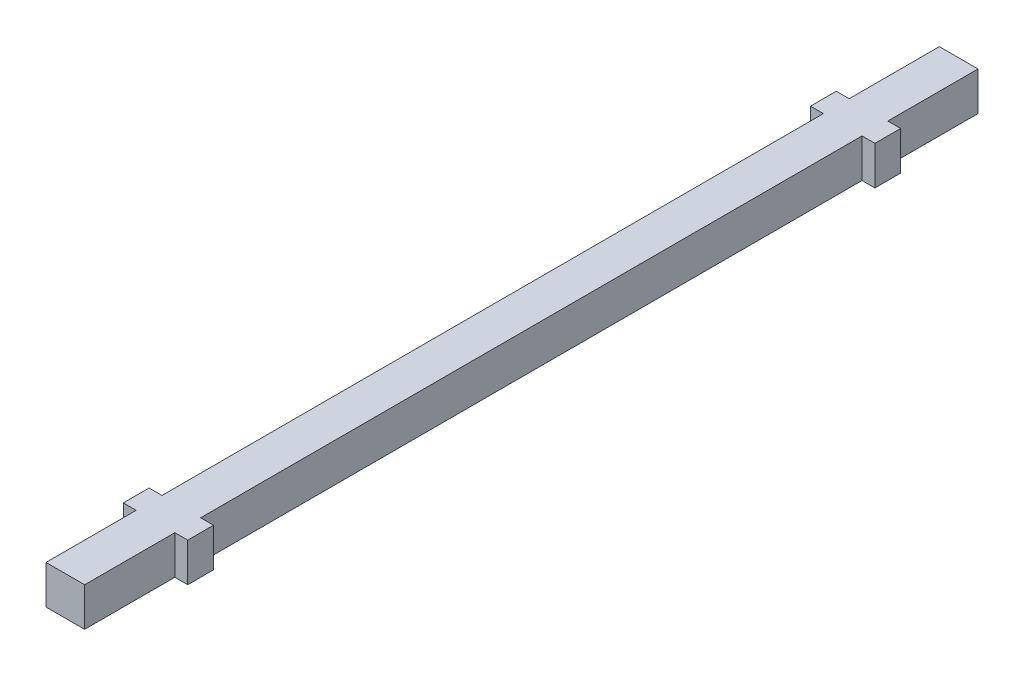
ISO-10303-21;
HEADER;
FILE_DESCRIPTION(('STEP AP214'),'2;1');
FILE_NAME('part.step','',(''),(''),'','','');
FILE_SCHEMA(('AUTOMOTIVE_DESIGN { 1 0 10303 214 1 1 1 1 }'));
ENDSEC;
DATA;
#1=APPLICATION_CONTEXT('core data for automotive mechanical design processes');
#2=APPLICATION_PROTOCOL_DEFINITION('international standard','automotive_design',2000,#1);
#3=PRODUCT_CONTEXT('',#1,'mechanical');
#4=PRODUCT('Part','Part','',(#3));
#5=PRODUCT_RELATED_PRODUCT_CATEGORY('part','',(#4));
#6=PRODUCT_DEFINITION_FORMATION('','',#4);
#7=PRODUCT_DEFINITION_CONTEXT('part definition',#1,'design');
#8=PRODUCT_DEFINITION('design','',#6,#7);
#9=PRODUCT_DEFINITION_SHAPE('','',#8);
#10=(LENGTH_UNIT() NAMED_UNIT(*) SI_UNIT(.MILLI.,.METRE.));
#11=(NAMED_UNIT(*) PLANE_ANGLE_UNIT() SI_UNIT($,.RADIAN.));
#12=(NAMED_UNIT(*) SI_UNIT($,.STERADIAN.) SOLID_ANGLE_UNIT());
#13=UNCERTAINTY_MEASURE_WITH_UNIT(LENGTH_MEASURE(1.E-05),#10,'distance_accuracy_value','');
#14=(GEOMETRIC_REPRESENTATION_CONTEXT(3) GLOBAL_UNCERTAINTY_ASSIGNED_CONTEXT((#13)) GLOBAL_UNIT_ASSIGNED_CONTEXT((#10,
#11,#12)) REPRESENTATION_CONTEXT('',''));
#15=CARTESIAN_POINT('',(0.,0.,0.));
#16=DIRECTION('',(0.,0.,1.));
#17=DIRECTION('',(1.,0.,0.));
#18=AXIS2_PLACEMENT_3D('',#15,#16,#17);
#19=CARTESIAN_POINT('',(-4.5,-4.5,104.));
#20=DIRECTION('',(1.,0.,0.));
#21=DIRECTION('',(0.,0.,-1.));
#22=AXIS2_PLACEMENT_3D('',#19,#20,#21);
#23=PLANE('',#22);
#24=DIRECTION('',(0.,-1.,0.));
#25=VECTOR('',#24,1.);
#26=CARTESIAN_POINT('',(-4.5,4.5,-83.));
#27=LINE('',#26,#25);
#28=CARTESIAN_POINT('',(-4.5,4.5,-83.));
#29=VERTEX_POINT('',#28);
#30=CARTESIAN_POINT('',(-4.5,-4.5,-82.9999999999999));
#31=VERTEX_POINT('',#30);
#32=EDGE_CURVE('E190',#29,#31,#27,.T.);
#33=ORIENTED_EDGE('',*,*,#32,.F.);
#34=DIRECTION('',(0.,0.,-1.));
#35=VECTOR('',#34,1.);
#36=CARTESIAN_POINT('',(-4.5,4.5,104.));
#37=LINE('',#36,#35);
#38=CARTESIAN_POINT('',(-4.5,4.5,-104.));
#39=VERTEX_POINT('',#38);
#40=EDGE_CURVE('E208',#29,#39,#37,.T.);
#41=ORIENTED_EDGE('',*,*,#40,.T.);
#42=DIRECTION('',(0.,-1.,0.));
#43=VECTOR('',#42,1.);
#44=CARTESIAN_POINT('',(-4.5,-4.5,-104.));
#45=LINE('',#44,#43);
#46=CARTESIAN_POINT('',(-4.5,-4.5,-104.));
#47=VERTEX_POINT('',#46);
#48=EDGE_CURVE('E225',#39,#47,#45,.T.);
#49=ORIENTED_EDGE('',*,*,#48,.T.);
#50=DIRECTION('',(0.,0.,-1.));
#51=VECTOR('',#50,1.);
#52=CARTESIAN_POINT('',(-4.5,-4.5,104.));
#53=LINE('',#52,#51);
#54=EDGE_CURVE('E215',#31,#47,#53,.T.);
#55=ORIENTED_EDGE('',*,*,#54,.F.);
#56=EDGE_LOOP('',(#33,#41,#49,#55));
#57=FACE_BOUND('',#56,.T.);
#58=ADVANCED_FACE('F41',(#57),#23,.F.);
#59=CARTESIAN_POINT('',(4.5,-4.5,104.));
#60=DIRECTION('',(-1.,0.,0.));
#61=DIRECTION('',(0.,0.,1.));
#62=AXIS2_PLACEMENT_3D('',#59,#60,#61);
#63=PLANE('',#62);
#64=DIRECTION('',(0.,0.,-1.));
#65=VECTOR('',#64,1.);
#66=CARTESIAN_POINT('',(4.5,-4.5,104.));
#67=LINE('',#66,#65);
#68=CARTESIAN_POINT('',(4.5,-4.5,77.));
#69=VERTEX_POINT('',#68);
#70=CARTESIAN_POINT('',(4.5,-4.5,-76.9999999999999));
#71=VERTEX_POINT('',#70);
#72=EDGE_CURVE('E219',#69,#71,#67,.T.);
#73=ORIENTED_EDGE('',*,*,#72,.T.);
#74=DIRECTION('',(0.,-1.,0.));
#75=VECTOR('',#74,1.);
#76=CARTESIAN_POINT('',(4.5,4.5,-77.));
#77=LINE('',#76,#75);
#78=CARTESIAN_POINT('',(4.5,4.5,-76.9999999999999));
#79=VERTEX_POINT('',#78);
#80=EDGE_CURVE('E296',#79,#71,#77,.T.);
#81=ORIENTED_EDGE('',*,*,#80,.F.);
#82=DIRECTION('',(0.,0.,-1.));
#83=VECTOR('',#82,1.);
#84=CARTESIAN_POINT('',(4.5,4.5,104.));
#85=LINE('',#84,#83);
#86=CARTESIAN_POINT('',(4.5,4.5,77.));
#87=VERTEX_POINT('',#86);
#88=EDGE_CURVE('E49',#87,#79,#85,.T.);
#89=ORIENTED_EDGE('',*,*,#88,.F.);
#90=DIRECTION('',(0.,-1.,0.));
#91=VECTOR('',#90,1.);
#92=CARTESIAN_POINT('',(4.5,4.5,77.));
#93=LINE('',#92,#91);
#94=EDGE_CURVE('E259',#87,#69,#93,.T.);
#95=ORIENTED_EDGE('',*,*,#94,.T.);
#96=EDGE_LOOP('',(#73,#81,#89,#95));
#97=FACE_BOUND('',#96,.T.);
#98=ADVANCED_FACE('F348',(#97),#63,.F.);
#99=DIRECTION('',(0.,-1.,0.));
#100=VECTOR('',#99,1.);
#101=CARTESIAN_POINT('',(4.5,4.5,83.));
#102=LINE('',#101,#100);
#103=CARTESIAN_POINT('',(4.5,4.5,83.));
#104=VERTEX_POINT('',#103);
#105=CARTESIAN_POINT('',(4.5,-4.5,83.));
#106=VERTEX_POINT('',#105);
#107=EDGE_CURVE('E267',#104,#106,#102,.T.);
#108=ORIENTED_EDGE('',*,*,#107,.F.);
#109=CARTESIAN_POINT('',(4.5,4.5,104.));
#110=VERTEX_POINT('',#109);
#111=EDGE_CURVE('E11',#110,#104,#85,.T.);
#112=ORIENTED_EDGE('',*,*,#111,.F.);
#113=DIRECTION('',(0.,1.,0.));
#114=VECTOR('',#113,1.);
#115=CARTESIAN_POINT('',(4.5,-4.5,104.));
#116=LINE('',#115,#114);
#117=CARTESIAN_POINT('',(4.5,-4.5,104.));
#118=VERTEX_POINT('',#117);
#119=EDGE_CURVE('E224',#118,#110,#116,.T.);
#120=ORIENTED_EDGE('',*,*,#119,.F.);
#121=EDGE_CURVE('E216',#118,#106,#67,.T.);
#122=ORIENTED_EDGE('',*,*,#121,.T.);
#123=EDGE_LOOP('',(#108,#112,#120,#122));
#124=FACE_BOUND('',#123,.T.);
#125=ADVANCED_FACE('F379',(#124),#63,.F.);
#126=CARTESIAN_POINT('',(-4.5,4.5,77.));
#127=VERTEX_POINT('',#126);
#128=CARTESIAN_POINT('',(-4.5,4.5,-77.));
#129=VERTEX_POINT('',#128);
#130=EDGE_CURVE('E197',#127,#129,#37,.T.);
#131=ORIENTED_EDGE('',*,*,#130,.T.);
#132=DIRECTION('',(0.,-1.,0.));
#133=VECTOR('',#132,1.);
#134=CARTESIAN_POINT('',(-4.5,4.5,-77.));
#135=LINE('',#134,#133);
#136=CARTESIAN_POINT('',(-4.5,-4.5,-77.));
#137=VERTEX_POINT('',#136);
#138=EDGE_CURVE('E179',#129,#137,#135,.T.);
#139=ORIENTED_EDGE('',*,*,#138,.T.);
#140=CARTESIAN_POINT('',(-4.5,-4.5,77.));
#141=VERTEX_POINT('',#140);
#142=EDGE_CURVE('E214',#141,#137,#53,.T.);
#143=ORIENTED_EDGE('',*,*,#142,.F.);
#144=DIRECTION('',(0.,-1.,0.));
#145=VECTOR('',#144,1.);
#146=CARTESIAN_POINT('',(-4.5,4.5,77.));
#147=LINE('',#146,#145);
#148=EDGE_CURVE('E206',#127,#141,#147,.T.);
#149=ORIENTED_EDGE('',*,*,#148,.F.);
#150=EDGE_LOOP('',(#131,#139,#143,#149));
#151=FACE_BOUND('',#150,.T.);
#152=ADVANCED_FACE('F205',(#151),#23,.F.);
#153=CARTESIAN_POINT('',(4.5,4.5,-82.9999999999999));
#154=VERTEX_POINT('',#153);
#155=CARTESIAN_POINT('',(4.5,4.5,-104.));
#156=VERTEX_POINT('',#155);
#157=EDGE_CURVE('E50',#154,#156,#85,.T.);
#158=ORIENTED_EDGE('',*,*,#157,.F.);
#159=DIRECTION('',(0.,-1.,0.));
#160=VECTOR('',#159,1.);
#161=CARTESIAN_POINT('',(4.5,4.5,-83.));
#162=LINE('',#161,#160);
#163=CARTESIAN_POINT('',(4.5,-4.5,-83.));
#164=VERTEX_POINT('',#163);
#165=EDGE_CURVE('E294',#154,#164,#162,.T.);
#166=ORIENTED_EDGE('',*,*,#165,.T.);
#167=CARTESIAN_POINT('',(4.5,-4.5,-104.));
#168=VERTEX_POINT('',#167);
#169=EDGE_CURVE('E220',#164,#168,#67,.T.);
#170=ORIENTED_EDGE('',*,*,#169,.T.);
#171=DIRECTION('',(0.,1.,0.));
#172=VECTOR('',#171,1.);
#173=CARTESIAN_POINT('',(4.5,-4.5,-104.));
#174=LINE('',#173,#172);
#175=EDGE_CURVE('E230',#168,#156,#174,.T.);
#176=ORIENTED_EDGE('',*,*,#175,.T.);
#177=EDGE_LOOP('',(#158,#166,#170,#176));
#178=FACE_BOUND('',#177,.T.);
#179=ADVANCED_FACE('F43',(#178),#63,.F.);
#180=CARTESIAN_POINT('',(-4.5,4.5,104.));
#181=DIRECTION('',(0.,-1.,0.));
#182=DIRECTION('',(0.,0.,-1.));
#183=AXIS2_PLACEMENT_3D('',#180,#181,#182);
#184=PLANE('',#183);
#185=DIRECTION('',(-1.,0.,0.));
#186=VECTOR('',#185,1.);
#187=CARTESIAN_POINT('',(-4.5,4.5,-104.));
#188=LINE('',#187,#186);
#189=EDGE_CURVE('E228',#156,#39,#188,.T.);
#190=ORIENTED_EDGE('',*,*,#189,.T.);
#191=ORIENTED_EDGE('',*,*,#40,.F.);
#192=DIRECTION('',(-1.,0.,0.));
#193=VECTOR('',#192,1.);
#194=CARTESIAN_POINT('',(-3.83952129349533E-13,4.5,-83.));
#195=LINE('',#194,#193);
#196=CARTESIAN_POINT('',(-7.5,4.5,-83.));
#197=VERTEX_POINT('',#196);
#198=EDGE_CURVE('E201',#29,#197,#195,.T.);
#199=ORIENTED_EDGE('',*,*,#198,.T.);
#200=DIRECTION('',(0.,0.,1.));
#201=VECTOR('',#200,1.);
#202=CARTESIAN_POINT('',(-7.5,4.5,0.));
#203=LINE('',#202,#201);
#204=CARTESIAN_POINT('',(-7.5,4.5,-77.));
#205=VERTEX_POINT('',#204);
#206=EDGE_CURVE('E199',#197,#205,#203,.T.);
#207=ORIENTED_EDGE('',*,*,#206,.T.);
#208=DIRECTION('',(-1.,0.,0.));
#209=VECTOR('',#208,1.);
#210=CARTESIAN_POINT('',(0.,4.5,-77.));
#211=LINE('',#210,#209);
#212=EDGE_CURVE('E182',#129,#205,#211,.T.);
#213=ORIENTED_EDGE('',*,*,#212,.F.);
#214=ORIENTED_EDGE('',*,*,#130,.F.);
#215=DIRECTION('',(1.,0.,0.));
#216=VECTOR('',#215,1.);
#217=CARTESIAN_POINT('',(0.,4.5,77.));
#218=LINE('',#217,#216);
#219=CARTESIAN_POINT('',(-7.5,4.5,77.));
#220=VERTEX_POINT('',#219);
#221=EDGE_CURVE('E252',#220,#127,#218,.T.);
#222=ORIENTED_EDGE('',*,*,#221,.F.);
#223=DIRECTION('',(0.,0.,1.));
#224=VECTOR('',#223,1.);
#225=CARTESIAN_POINT('',(-7.5,4.5,0.));
#226=LINE('',#225,#224);
#227=CARTESIAN_POINT('',(-7.5,4.5,83.));
#228=VERTEX_POINT('',#227);
#229=EDGE_CURVE('E262',#220,#228,#226,.T.);
#230=ORIENTED_EDGE('',*,*,#229,.T.);
#231=DIRECTION('',(-1.,0.,0.));
#232=VECTOR('',#231,1.);
#233=CARTESIAN_POINT('',(-3.83952129349533E-13,4.5,83.));
#234=LINE('',#233,#232);
#235=CARTESIAN_POINT('',(-4.5,4.5,83.));
#236=VERTEX_POINT('',#235);
#237=EDGE_CURVE('E248',#236,#228,#234,.T.);
#238=ORIENTED_EDGE('',*,*,#237,.F.);
#239=CARTESIAN_POINT('',(-4.5,4.5,104.));
#240=VERTEX_POINT('',#239);
#241=EDGE_CURVE('E207',#240,#236,#37,.T.);
#242=ORIENTED_EDGE('',*,*,#241,.F.);
#243=DIRECTION('',(-1.,0.,0.));
#244=VECTOR('',#243,1.);
#245=CARTESIAN_POINT('',(-4.5,4.5,104.));
#246=LINE('',#245,#244);
#247=EDGE_CURVE('E237',#110,#240,#246,.T.);
#248=ORIENTED_EDGE('',*,*,#247,.F.);
#249=ORIENTED_EDGE('',*,*,#111,.T.);
#250=DIRECTION('',(1.,0.,0.));
#251=VECTOR('',#250,1.);
#252=CARTESIAN_POINT('',(0.,4.5,83.));
#253=LINE('',#252,#251);
#254=CARTESIAN_POINT('',(7.5,4.5,83.));
#255=VERTEX_POINT('',#254);
#256=EDGE_CURVE('E287',#104,#255,#253,.T.);
#257=ORIENTED_EDGE('',*,*,#256,.T.);
#258=DIRECTION('',(0.,0.,1.));
#259=VECTOR('',#258,1.);
#260=CARTESIAN_POINT('',(7.5,4.5,0.));
#261=LINE('',#260,#259);
#262=CARTESIAN_POINT('',(7.5,4.5,77.));
#263=VERTEX_POINT('',#262);
#264=EDGE_CURVE('E273',#263,#255,#261,.T.);
#265=ORIENTED_EDGE('',*,*,#264,.F.);
#266=DIRECTION('',(1.,0.,0.));
#267=VECTOR('',#266,1.);
#268=CARTESIAN_POINT('',(0.,4.5,77.));
#269=LINE('',#268,#267);
#270=EDGE_CURVE('E277',#87,#263,#269,.T.);
#271=ORIENTED_EDGE('',*,*,#270,.F.);
#272=ORIENTED_EDGE('',*,*,#88,.T.);
#273=DIRECTION('',(-1.,0.,0.));
#274=VECTOR('',#273,1.);
#275=CARTESIAN_POINT('',(0.,4.5,-77.));
#276=LINE('',#275,#274);
#277=CARTESIAN_POINT('',(7.5,4.5,-77.));
#278=VERTEX_POINT('',#277);
#279=EDGE_CURVE('E303',#278,#79,#276,.T.);
#280=ORIENTED_EDGE('',*,*,#279,.F.);
#281=DIRECTION('',(0.,0.,1.));
#282=VECTOR('',#281,1.);
#283=CARTESIAN_POINT('',(7.5,4.5,0.));
#284=LINE('',#283,#282);
#285=CARTESIAN_POINT('',(7.5,4.5,-83.));
#286=VERTEX_POINT('',#285);
#287=EDGE_CURVE('E311',#286,#278,#284,.T.);
#288=ORIENTED_EDGE('',*,*,#287,.F.);
#289=DIRECTION('',(1.,0.,0.));
#290=VECTOR('',#289,1.);
#291=CARTESIAN_POINT('',(3.83952129349533E-13,4.5,-83.));
#292=LINE('',#291,#290);
#293=EDGE_CURVE('E299',#154,#286,#292,.T.);
#294=ORIENTED_EDGE('',*,*,#293,.F.);
#295=ORIENTED_EDGE('',*,*,#157,.T.);
#296=EDGE_LOOP('',(#190,#191,#199,#207,#213,#214,#222,#230,#238,#242,#248,#249,#257,#265,#271,
#272,#280,#288,#294,#295));
#297=FACE_BOUND('',#296,.T.);
#298=ADVANCED_FACE('F195',(#297),#184,.F.);
#299=ORIENTED_EDGE('',*,*,#241,.T.);
#300=DIRECTION('',(0.,-1.,0.));
#301=VECTOR('',#300,1.);
#302=CARTESIAN_POINT('',(-4.5,4.5,83.));
#303=LINE('',#302,#301);
#304=CARTESIAN_POINT('',(-4.5,-4.5,83.));
#305=VERTEX_POINT('',#304);
#306=EDGE_CURVE('E244',#236,#305,#303,.T.);
#307=ORIENTED_EDGE('',*,*,#306,.T.);
#308=CARTESIAN_POINT('',(-4.5,-4.5,104.));
#309=VERTEX_POINT('',#308);
#310=EDGE_CURVE('E210',#309,#305,#53,.T.);
#311=ORIENTED_EDGE('',*,*,#310,.F.);
#312=DIRECTION('',(0.,-1.,0.));
#313=VECTOR('',#312,1.);
#314=CARTESIAN_POINT('',(-4.5,-4.5,104.));
#315=LINE('',#314,#313);
#316=EDGE_CURVE('E235',#240,#309,#315,.T.);
#317=ORIENTED_EDGE('',*,*,#316,.F.);
#318=EDGE_LOOP('',(#299,#307,#311,#317));
#319=FACE_BOUND('',#318,.T.);
#320=ADVANCED_FACE('F374',(#319),#23,.F.);
#321=CARTESIAN_POINT('',(-4.5,-4.5,104.));
#322=DIRECTION('',(0.,1.,0.));
#323=DIRECTION('',(0.,0.,1.));
#324=AXIS2_PLACEMENT_3D('',#321,#322,#323);
#325=PLANE('',#324);
#326=DIRECTION('',(1.,0.,0.));
#327=VECTOR('',#326,1.);
#328=CARTESIAN_POINT('',(-4.5,-4.5,-104.));
#329=LINE('',#328,#327);
#330=EDGE_CURVE('E221',#47,#168,#329,.T.);
#331=ORIENTED_EDGE('',*,*,#330,.T.);
#332=ORIENTED_EDGE('',*,*,#169,.F.);
#333=DIRECTION('',(1.,0.,0.));
#334=VECTOR('',#333,1.);
#335=CARTESIAN_POINT('',(3.83952129349533E-13,-4.5,-83.));
#336=LINE('',#335,#334);
#337=CARTESIAN_POINT('',(7.5,-4.5,-83.));
#338=VERTEX_POINT('',#337);
#339=EDGE_CURVE('E300',#164,#338,#336,.T.);
#340=ORIENTED_EDGE('',*,*,#339,.T.);
#341=DIRECTION('',(0.,0.,1.));
#342=VECTOR('',#341,1.);
#343=CARTESIAN_POINT('',(7.5,-4.5,0.));
#344=LINE('',#343,#342);
#345=CARTESIAN_POINT('',(7.5,-4.5,-77.));
#346=VERTEX_POINT('',#345);
#347=EDGE_CURVE('E304',#338,#346,#344,.T.);
#348=ORIENTED_EDGE('',*,*,#347,.T.);
#349=DIRECTION('',(-1.,0.,0.));
#350=VECTOR('',#349,1.);
#351=CARTESIAN_POINT('',(0.,-4.5,-77.));
#352=LINE('',#351,#350);
#353=EDGE_CURVE('E189',#346,#71,#352,.T.);
#354=ORIENTED_EDGE('',*,*,#353,.T.);
#355=ORIENTED_EDGE('',*,*,#72,.F.);
#356=DIRECTION('',(1.,0.,0.));
#357=VECTOR('',#356,1.);
#358=CARTESIAN_POINT('',(0.,-4.5,77.));
#359=LINE('',#358,#357);
#360=CARTESIAN_POINT('',(7.5,-4.5,77.));
#361=VERTEX_POINT('',#360);
#362=EDGE_CURVE('E281',#69,#361,#359,.T.);
#363=ORIENTED_EDGE('',*,*,#362,.T.);
#364=DIRECTION('',(0.,0.,1.));
#365=VECTOR('',#364,1.);
#366=CARTESIAN_POINT('',(7.5,-4.5,0.));
#367=LINE('',#366,#365);
#368=CARTESIAN_POINT('',(7.5,-4.5,83.));
#369=VERTEX_POINT('',#368);
#370=EDGE_CURVE('E274',#361,#369,#367,.T.);
#371=ORIENTED_EDGE('',*,*,#370,.T.);
#372=DIRECTION('',(1.,0.,0.));
#373=VECTOR('',#372,1.);
#374=CARTESIAN_POINT('',(0.,-4.5,83.));
#375=LINE('',#374,#373);
#376=EDGE_CURVE('E278',#106,#369,#375,.T.);
#377=ORIENTED_EDGE('',*,*,#376,.F.);
#378=ORIENTED_EDGE('',*,*,#121,.F.);
#379=DIRECTION('',(1.,0.,0.));
#380=VECTOR('',#379,1.);
#381=CARTESIAN_POINT('',(-4.5,-4.5,104.));
#382=LINE('',#381,#380);
#383=EDGE_CURVE('E233',#309,#118,#382,.T.);
#384=ORIENTED_EDGE('',*,*,#383,.F.);
#385=ORIENTED_EDGE('',*,*,#310,.T.);
#386=DIRECTION('',(-1.,0.,0.));
#387=VECTOR('',#386,1.);
#388=CARTESIAN_POINT('',(-3.83952129349533E-13,-4.5,83.));
#389=LINE('',#388,#387);
#390=CARTESIAN_POINT('',(-7.5,-4.5,83.));
#391=VERTEX_POINT('',#390);
#392=EDGE_CURVE('E249',#305,#391,#389,.T.);
#393=ORIENTED_EDGE('',*,*,#392,.T.);
#394=DIRECTION('',(0.,0.,1.));
#395=VECTOR('',#394,1.);
#396=CARTESIAN_POINT('',(-7.5,-4.5,0.));
#397=LINE('',#396,#395);
#398=CARTESIAN_POINT('',(-7.5,-4.5,77.));
#399=VERTEX_POINT('',#398);
#400=EDGE_CURVE('E253',#399,#391,#397,.T.);
#401=ORIENTED_EDGE('',*,*,#400,.F.);
#402=DIRECTION('',(1.,0.,0.));
#403=VECTOR('',#402,1.);
#404=CARTESIAN_POINT('',(0.,-4.5,77.));
#405=LINE('',#404,#403);
#406=EDGE_CURVE('E256',#399,#141,#405,.T.);
#407=ORIENTED_EDGE('',*,*,#406,.T.);
#408=ORIENTED_EDGE('',*,*,#142,.T.);
#409=DIRECTION('',(-1.,0.,0.));
#410=VECTOR('',#409,1.);
#411=CARTESIAN_POINT('',(0.,-4.5,-77.));
#412=LINE('',#411,#410);
#413=CARTESIAN_POINT('',(-7.5,-4.5,-77.));
#414=VERTEX_POINT('',#413);
#415=EDGE_CURVE('E184',#137,#414,#412,.T.);
#416=ORIENTED_EDGE('',*,*,#415,.T.);
#417=DIRECTION('',(0.,0.,1.));
#418=VECTOR('',#417,1.);
#419=CARTESIAN_POINT('',(-7.5,-4.5,0.));
#420=LINE('',#419,#418);
#421=CARTESIAN_POINT('',(-7.5,-4.5,-83.));
#422=VERTEX_POINT('',#421);
#423=EDGE_CURVE('E202',#422,#414,#420,.T.);
#424=ORIENTED_EDGE('',*,*,#423,.F.);
#425=DIRECTION('',(-1.,0.,0.));
#426=VECTOR('',#425,1.);
#427=CARTESIAN_POINT('',(-3.83952129349533E-13,-4.5,-83.));
#428=LINE('',#427,#426);
#429=EDGE_CURVE('E57',#31,#422,#428,.T.);
#430=ORIENTED_EDGE('',*,*,#429,.F.);
#431=ORIENTED_EDGE('',*,*,#54,.T.);
#432=EDGE_LOOP('',(#331,#332,#340,#348,#354,#355,#363,#371,#377,#378,#384,#385,#393,#401,#407,
#408,#416,#424,#430,#431));
#433=FACE_BOUND('',#432,.T.);
#434=ADVANCED_FACE('F334',(#433),#325,.F.);
#435=CARTESIAN_POINT('',(0.,0.,104.));
#436=DIRECTION('',(0.,0.,-1.));
#437=DIRECTION('',(-1.,0.,0.));
#438=AXIS2_PLACEMENT_3D('',#435,#436,#437);
#439=PLANE('',#438);
#440=ORIENTED_EDGE('',*,*,#119,.T.);
#441=ORIENTED_EDGE('',*,*,#247,.T.);
#442=ORIENTED_EDGE('',*,*,#316,.T.);
#443=ORIENTED_EDGE('',*,*,#383,.T.);
#444=EDGE_LOOP('',(#440,#441,#442,#443));
#445=FACE_BOUND('',#444,.T.);
#446=ADVANCED_FACE('F388',(#445),#439,.F.);
#447=CARTESIAN_POINT('',(0.,0.,-104.));
#448=DIRECTION('',(0.,0.,-1.));
#449=DIRECTION('',(-1.,0.,0.));
#450=AXIS2_PLACEMENT_3D('',#447,#448,#449);
#451=PLANE('',#450);
#452=ORIENTED_EDGE('',*,*,#175,.F.);
#453=ORIENTED_EDGE('',*,*,#330,.F.);
#454=ORIENTED_EDGE('',*,*,#48,.F.);
#455=ORIENTED_EDGE('',*,*,#189,.F.);
#456=EDGE_LOOP('',(#452,#453,#454,#455));
#457=FACE_BOUND('',#456,.T.);
#458=ADVANCED_FACE('F344',(#457),#451,.T.);
#459=CARTESIAN_POINT('',(0.,4.5,77.));
#460=DIRECTION('',(0.,0.,-1.));
#461=DIRECTION('',(-1.,0.,0.));
#462=AXIS2_PLACEMENT_3D('',#459,#460,#461);
#463=PLANE('',#462);
#464=ORIENTED_EDGE('',*,*,#406,.F.);
#465=DIRECTION('',(0.,-1.,0.));
#466=VECTOR('',#465,1.);
#467=CARTESIAN_POINT('',(-7.5,4.5,77.));
#468=LINE('',#467,#466);
#469=EDGE_CURVE('E232',#220,#399,#468,.T.);
#470=ORIENTED_EDGE('',*,*,#469,.F.);
#471=ORIENTED_EDGE('',*,*,#221,.T.);
#472=ORIENTED_EDGE('',*,*,#148,.T.);
#473=EDGE_LOOP('',(#464,#470,#471,#472));
#474=FACE_BOUND('',#473,.T.);
#475=ADVANCED_FACE('F426',(#474),#463,.T.);
#476=CARTESIAN_POINT('',(-7.5,4.5,0.));
#477=DIRECTION('',(1.,0.,0.));
#478=DIRECTION('',(0.,0.,-1.));
#479=AXIS2_PLACEMENT_3D('',#476,#477,#478);
#480=PLANE('',#479);
#481=ORIENTED_EDGE('',*,*,#400,.T.);
#482=DIRECTION('',(0.,-1.,0.));
#483=VECTOR('',#482,1.);
#484=CARTESIAN_POINT('',(-7.5,4.5,83.));
#485=LINE('',#484,#483);
#486=EDGE_CURVE('E242',#228,#391,#485,.T.);
#487=ORIENTED_EDGE('',*,*,#486,.F.);
#488=ORIENTED_EDGE('',*,*,#229,.F.);
#489=ORIENTED_EDGE('',*,*,#469,.T.);
#490=EDGE_LOOP('',(#481,#487,#488,#489));
#491=FACE_BOUND('',#490,.T.);
#492=ADVANCED_FACE('F420',(#491),#480,.F.);
#493=CARTESIAN_POINT('',(-3.83952129349533E-13,4.5,83.));
#494=DIRECTION('',(0.,0.,1.));
#495=DIRECTION('',(1.,0.,0.));
#496=AXIS2_PLACEMENT_3D('',#493,#494,#495);
#497=PLANE('',#496);
#498=ORIENTED_EDGE('',*,*,#392,.F.);
#499=ORIENTED_EDGE('',*,*,#306,.F.);
#500=ORIENTED_EDGE('',*,*,#237,.T.);
#501=ORIENTED_EDGE('',*,*,#486,.T.);
#502=EDGE_LOOP('',(#498,#499,#500,#501));
#503=FACE_BOUND('',#502,.T.);
#504=ADVANCED_FACE('F396',(#503),#497,.T.);
#505=CARTESIAN_POINT('',(0.,4.5,77.));
#506=DIRECTION('',(0.,0.,-1.));
#507=DIRECTION('',(-1.,0.,0.));
#508=AXIS2_PLACEMENT_3D('',#505,#506,#507);
#509=PLANE('',#508);
#510=ORIENTED_EDGE('',*,*,#362,.F.);
#511=ORIENTED_EDGE('',*,*,#94,.F.);
#512=ORIENTED_EDGE('',*,*,#270,.T.);
#513=DIRECTION('',(0.,-1.,0.));
#514=VECTOR('',#513,1.);
#515=CARTESIAN_POINT('',(7.5,4.5,77.));
#516=LINE('',#515,#514);
#517=EDGE_CURVE('E271',#263,#361,#516,.T.);
#518=ORIENTED_EDGE('',*,*,#517,.T.);
#519=EDGE_LOOP('',(#510,#511,#512,#518));
#520=FACE_BOUND('',#519,.T.);
#521=ADVANCED_FACE('F412',(#520),#509,.T.);
#522=CARTESIAN_POINT('',(0.,4.5,83.));
#523=DIRECTION('',(0.,0.,-1.));
#524=DIRECTION('',(-1.,0.,0.));
#525=AXIS2_PLACEMENT_3D('',#522,#523,#524);
#526=PLANE('',#525);
#527=ORIENTED_EDGE('',*,*,#376,.T.);
#528=DIRECTION('',(0.,-1.,0.));
#529=VECTOR('',#528,1.);
#530=CARTESIAN_POINT('',(7.5,4.5,83.));
#531=LINE('',#530,#529);
#532=EDGE_CURVE('E269',#255,#369,#531,.T.);
#533=ORIENTED_EDGE('',*,*,#532,.F.);
#534=ORIENTED_EDGE('',*,*,#256,.F.);
#535=ORIENTED_EDGE('',*,*,#107,.T.);
#536=EDGE_LOOP('',(#527,#533,#534,#535));
#537=FACE_BOUND('',#536,.T.);
#538=ADVANCED_FACE('F407',(#537),#526,.F.);
#539=CARTESIAN_POINT('',(7.5,4.5,0.));
#540=DIRECTION('',(1.,0.,0.));
#541=DIRECTION('',(0.,0.,-1.));
#542=AXIS2_PLACEMENT_3D('',#539,#540,#541);
#543=PLANE('',#542);
#544=ORIENTED_EDGE('',*,*,#370,.F.);
#545=ORIENTED_EDGE('',*,*,#517,.F.);
#546=ORIENTED_EDGE('',*,*,#264,.T.);
#547=ORIENTED_EDGE('',*,*,#532,.T.);
#548=EDGE_LOOP('',(#544,#545,#546,#547));
#549=FACE_BOUND('',#548,.T.);
#550=ADVANCED_FACE('F410',(#549),#543,.T.);
#551=CARTESIAN_POINT('',(0.,4.5,-77.));
#552=DIRECTION('',(0.,0.,1.));
#553=DIRECTION('',(1.,0.,0.));
#554=AXIS2_PLACEMENT_3D('',#551,#552,#553);
#555=PLANE('',#554);
#556=ORIENTED_EDGE('',*,*,#353,.F.);
#557=DIRECTION('',(0.,-1.,0.));
#558=VECTOR('',#557,1.);
#559=CARTESIAN_POINT('',(7.5,4.5,-77.));
#560=LINE('',#559,#558);
#561=EDGE_CURVE('E284',#278,#346,#560,.T.);
#562=ORIENTED_EDGE('',*,*,#561,.F.);
#563=ORIENTED_EDGE('',*,*,#279,.T.);
#564=ORIENTED_EDGE('',*,*,#80,.T.);
#565=EDGE_LOOP('',(#556,#562,#563,#564));
#566=FACE_BOUND('',#565,.T.);
#567=ADVANCED_FACE('F353',(#566),#555,.T.);
#568=CARTESIAN_POINT('',(7.5,4.5,0.));
#569=DIRECTION('',(1.,0.,0.));
#570=DIRECTION('',(0.,0.,-1.));
#571=AXIS2_PLACEMENT_3D('',#568,#569,#570);
#572=PLANE('',#571);
#573=ORIENTED_EDGE('',*,*,#347,.F.);
#574=DIRECTION('',(0.,-1.,0.));
#575=VECTOR('',#574,1.);
#576=CARTESIAN_POINT('',(7.5,4.5,-83.));
#577=LINE('',#576,#575);
#578=EDGE_CURVE('E292',#286,#338,#577,.T.);
#579=ORIENTED_EDGE('',*,*,#578,.F.);
#580=ORIENTED_EDGE('',*,*,#287,.T.);
#581=ORIENTED_EDGE('',*,*,#561,.T.);
#582=EDGE_LOOP('',(#573,#579,#580,#581));
#583=FACE_BOUND('',#582,.T.);
#584=ADVANCED_FACE('F357',(#583),#572,.T.);
#585=CARTESIAN_POINT('',(3.83952129349533E-13,4.5,-83.));
#586=DIRECTION('',(0.,0.,-1.));
#587=DIRECTION('',(-1.,0.,0.));
#588=AXIS2_PLACEMENT_3D('',#585,#586,#587);
#589=PLANE('',#588);
#590=ORIENTED_EDGE('',*,*,#339,.F.);
#591=ORIENTED_EDGE('',*,*,#165,.F.);
#592=ORIENTED_EDGE('',*,*,#293,.T.);
#593=ORIENTED_EDGE('',*,*,#578,.T.);
#594=EDGE_LOOP('',(#590,#591,#592,#593));
#595=FACE_BOUND('',#594,.T.);
#596=ADVANCED_FACE('F363',(#595),#589,.T.);
#597=CARTESIAN_POINT('',(0.,4.5,-77.));
#598=DIRECTION('',(0.,0.,1.));
#599=DIRECTION('',(1.,0.,0.));
#600=AXIS2_PLACEMENT_3D('',#597,#598,#599);
#601=PLANE('',#600);
#602=ORIENTED_EDGE('',*,*,#415,.F.);
#603=ORIENTED_EDGE('',*,*,#138,.F.);
#604=ORIENTED_EDGE('',*,*,#212,.T.);
#605=DIRECTION('',(0.,-1.,0.));
#606=VECTOR('',#605,1.);
#607=CARTESIAN_POINT('',(-7.5,4.5,-77.));
#608=LINE('',#607,#606);
#609=EDGE_CURVE('E320',#205,#414,#608,.T.);
#610=ORIENTED_EDGE('',*,*,#609,.T.);
#611=EDGE_LOOP('',(#602,#603,#604,#610));
#612=FACE_BOUND('',#611,.T.);
#613=ADVANCED_FACE('F181',(#612),#601,.T.);
#614=CARTESIAN_POINT('',(-3.83952129349533E-13,4.5,-83.));
#615=DIRECTION('',(0.,0.,1.));
#616=DIRECTION('',(1.,0.,0.));
#617=AXIS2_PLACEMENT_3D('',#614,#615,#616);
#618=PLANE('',#617);
#619=ORIENTED_EDGE('',*,*,#429,.T.);
#620=DIRECTION('',(0.,-1.,0.));
#621=VECTOR('',#620,1.);
#622=CARTESIAN_POINT('',(-7.5,4.5,-83.));
#623=LINE('',#622,#621);
#624=EDGE_CURVE('E317',#197,#422,#623,.T.);
#625=ORIENTED_EDGE('',*,*,#624,.F.);
#626=ORIENTED_EDGE('',*,*,#198,.F.);
#627=ORIENTED_EDGE('',*,*,#32,.T.);
#628=EDGE_LOOP('',(#619,#625,#626,#627));
#629=FACE_BOUND('',#628,.T.);
#630=ADVANCED_FACE('F331',(#629),#618,.F.);
#631=CARTESIAN_POINT('',(-7.5,4.5,0.));
#632=DIRECTION('',(1.,0.,0.));
#633=DIRECTION('',(0.,0.,-1.));
#634=AXIS2_PLACEMENT_3D('',#631,#632,#633);
#635=PLANE('',#634);
#636=ORIENTED_EDGE('',*,*,#423,.T.);
#637=ORIENTED_EDGE('',*,*,#609,.F.);
#638=ORIENTED_EDGE('',*,*,#206,.F.);
#639=ORIENTED_EDGE('',*,*,#624,.T.);
#640=EDGE_LOOP('',(#636,#637,#638,#639));
#641=FACE_BOUND('',#640,.T.);
#642=ADVANCED_FACE('F333',(#641),#635,.F.);
#643=CLOSED_SHELL('',(#58,#98,#125,#152,#179,#298,#320,#434,#446,#458,#475,#492,#504,#521,#538,
#550,#567,#584,#596,#613,#630,#642));
#644=MANIFOLD_SOLID_BREP('B2',#643);
#645=ADVANCED_BREP_SHAPE_REPRESENTATION('',(#18,#644),#14);
#646=SHAPE_DEFINITION_REPRESENTATION(#9,#645);
ENDSEC;
END-ISO-10303-21;
